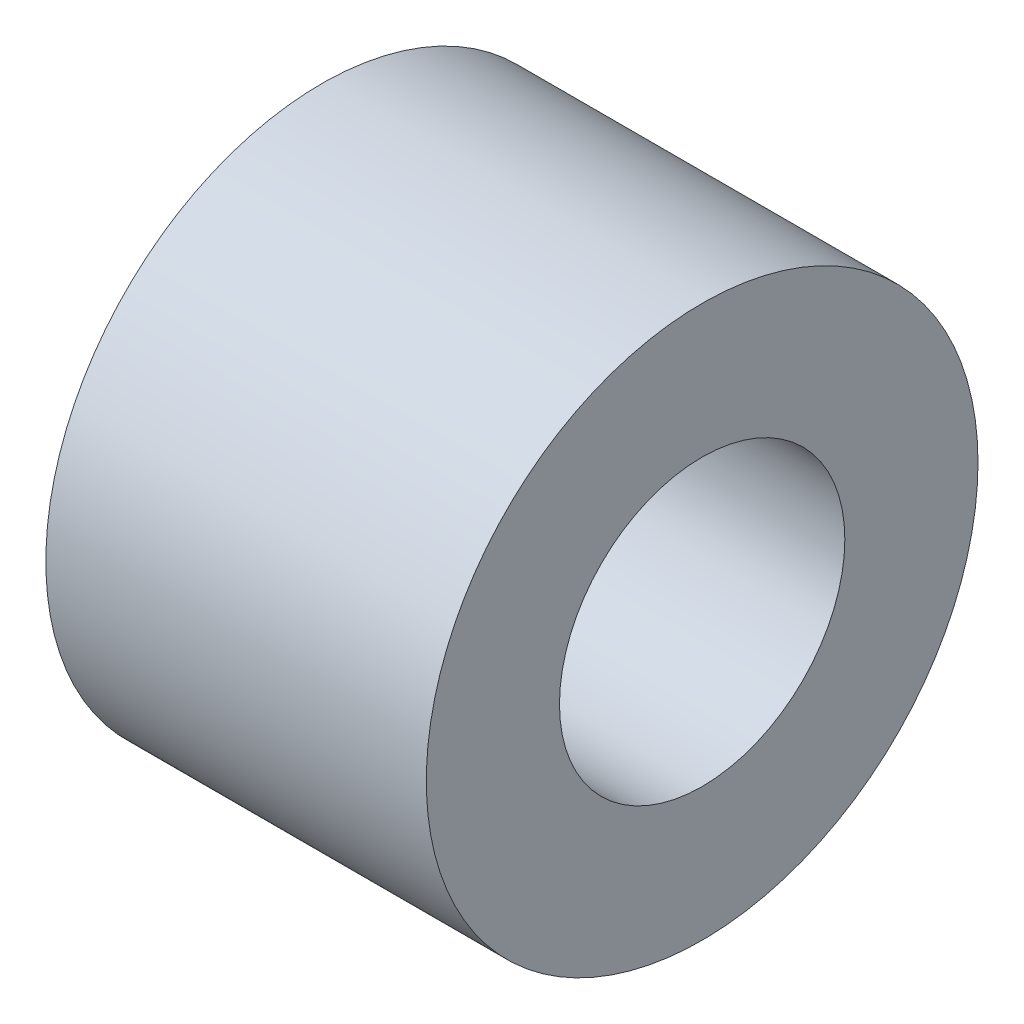
ISO-10303-21;
HEADER;
FILE_DESCRIPTION(('STEP AP214'),'2;1');
FILE_NAME('part.step','',(''),(''),'','','');
FILE_SCHEMA(('AUTOMOTIVE_DESIGN { 1 0 10303 214 1 1 1 1 }'));
ENDSEC;
DATA;
#1=APPLICATION_CONTEXT('core data for automotive mechanical design processes');
#2=APPLICATION_PROTOCOL_DEFINITION('international standard','automotive_design',2000,#1);
#3=PRODUCT_CONTEXT('',#1,'mechanical');
#4=PRODUCT('Part','Part','',(#3));
#5=PRODUCT_RELATED_PRODUCT_CATEGORY('part','',(#4));
#6=PRODUCT_DEFINITION_FORMATION('','',#4);
#7=PRODUCT_DEFINITION_CONTEXT('part definition',#1,'design');
#8=PRODUCT_DEFINITION('design','',#6,#7);
#9=PRODUCT_DEFINITION_SHAPE('','',#8);
#10=(LENGTH_UNIT() NAMED_UNIT(*) SI_UNIT(.MILLI.,.METRE.));
#11=(NAMED_UNIT(*) PLANE_ANGLE_UNIT() SI_UNIT($,.RADIAN.));
#12=(NAMED_UNIT(*) SI_UNIT($,.STERADIAN.) SOLID_ANGLE_UNIT());
#13=UNCERTAINTY_MEASURE_WITH_UNIT(LENGTH_MEASURE(1.E-05),#10,'distance_accuracy_value','');
#14=(GEOMETRIC_REPRESENTATION_CONTEXT(3) GLOBAL_UNCERTAINTY_ASSIGNED_CONTEXT((#13)) GLOBAL_UNIT_ASSIGNED_CONTEXT((#10,
#11,#12)) REPRESENTATION_CONTEXT('',''));
#15=CARTESIAN_POINT('',(0.,0.,0.));
#16=DIRECTION('',(0.,0.,1.));
#17=DIRECTION('',(1.,0.,0.));
#18=AXIS2_PLACEMENT_3D('',#15,#16,#17);
#19=CARTESIAN_POINT('',(4.,0.,0.));
#20=DIRECTION('',(1.,0.,0.));
#21=DIRECTION('',(0.,0.,-1.));
#22=AXIS2_PLACEMENT_3D('',#19,#20,#21);
#23=PLANE('',#22);
#24=CARTESIAN_POINT('',(4.,0.,0.));
#25=DIRECTION('',(1.,0.,0.));
#26=DIRECTION('',(0.,0.,-1.));
#27=AXIS2_PLACEMENT_3D('',#24,#25,#26);
#28=CIRCLE('',#27,2.9);
#29=CARTESIAN_POINT('',(4.,0.,-2.9));
#30=VERTEX_POINT('',#29);
#31=EDGE_CURVE('E10',#30,#30,#28,.T.);
#32=ORIENTED_EDGE('',*,*,#31,.T.);
#33=EDGE_LOOP('',(#32));
#34=FACE_BOUND('',#33,.T.);
#35=CARTESIAN_POINT('',(4.,0.,0.));
#36=DIRECTION('',(1.,0.,0.));
#37=DIRECTION('',(0.,0.,-1.));
#38=AXIS2_PLACEMENT_3D('',#35,#36,#37);
#39=CIRCLE('',#38,1.5);
#40=CARTESIAN_POINT('',(4.,0.,-1.5));
#41=VERTEX_POINT('',#40);
#42=EDGE_CURVE('E44',#41,#41,#39,.T.);
#43=ORIENTED_EDGE('',*,*,#42,.F.);
#44=EDGE_LOOP('',(#43));
#45=FACE_BOUND('',#44,.T.);
#46=ADVANCED_FACE('F33',(#34,#45),#23,.T.);
#47=CARTESIAN_POINT('',(0.,0.,0.));
#48=DIRECTION('',(1.,0.,0.));
#49=DIRECTION('',(0.,0.,-1.));
#50=AXIS2_PLACEMENT_3D('',#47,#48,#49);
#51=PLANE('',#50);
#52=CARTESIAN_POINT('',(0.,0.,0.));
#53=DIRECTION('',(1.,0.,0.));
#54=DIRECTION('',(0.,0.,-1.));
#55=AXIS2_PLACEMENT_3D('',#52,#53,#54);
#56=CIRCLE('',#55,2.9);
#57=CARTESIAN_POINT('',(0.,0.,-2.9));
#58=VERTEX_POINT('',#57);
#59=EDGE_CURVE('E40',#58,#58,#56,.T.);
#60=ORIENTED_EDGE('',*,*,#59,.F.);
#61=EDGE_LOOP('',(#60));
#62=FACE_BOUND('',#61,.T.);
#63=CARTESIAN_POINT('',(0.,0.,0.));
#64=DIRECTION('',(1.,0.,0.));
#65=DIRECTION('',(0.,0.,-1.));
#66=AXIS2_PLACEMENT_3D('',#63,#64,#65);
#67=CIRCLE('',#66,1.5);
#68=CARTESIAN_POINT('',(0.,0.,-1.5));
#69=VERTEX_POINT('',#68);
#70=EDGE_CURVE('E48',#69,#69,#67,.T.);
#71=ORIENTED_EDGE('',*,*,#70,.T.);
#72=EDGE_LOOP('',(#71));
#73=FACE_BOUND('',#72,.T.);
#74=ADVANCED_FACE('F54',(#62,#73),#51,.F.);
#75=CARTESIAN_POINT('',(4.,0.,0.));
#76=DIRECTION('',(-1.,0.,0.));
#77=DIRECTION('',(0.,0.,1.));
#78=AXIS2_PLACEMENT_3D('',#75,#76,#77);
#79=CYLINDRICAL_SURFACE('',#78,2.9);
#80=ORIENTED_EDGE('',*,*,#31,.F.);
#81=EDGE_LOOP('',(#80));
#82=FACE_BOUND('',#81,.T.);
#83=ORIENTED_EDGE('',*,*,#59,.T.);
#84=EDGE_LOOP('',(#83));
#85=FACE_BOUND('',#84,.T.);
#86=ADVANCED_FACE('F35',(#82,#85),#79,.T.);
#87=CARTESIAN_POINT('',(4.,0.,0.));
#88=DIRECTION('',(-1.,0.,0.));
#89=DIRECTION('',(0.,0.,1.));
#90=AXIS2_PLACEMENT_3D('',#87,#88,#89);
#91=CYLINDRICAL_SURFACE('',#90,1.5);
#92=ORIENTED_EDGE('',*,*,#42,.T.);
#93=EDGE_LOOP('',(#92));
#94=FACE_BOUND('',#93,.T.);
#95=ORIENTED_EDGE('',*,*,#70,.F.);
#96=EDGE_LOOP('',(#95));
#97=FACE_BOUND('',#96,.T.);
#98=ADVANCED_FACE('F56',(#94,#97),#91,.F.);
#99=CLOSED_SHELL('',(#46,#74,#86,#98));
#100=MANIFOLD_SOLID_BREP('B2',#99);
#101=ADVANCED_BREP_SHAPE_REPRESENTATION('',(#18,#100),#14);
#102=SHAPE_DEFINITION_REPRESENTATION(#9,#101);
ENDSEC;
END-ISO-10303-21;
